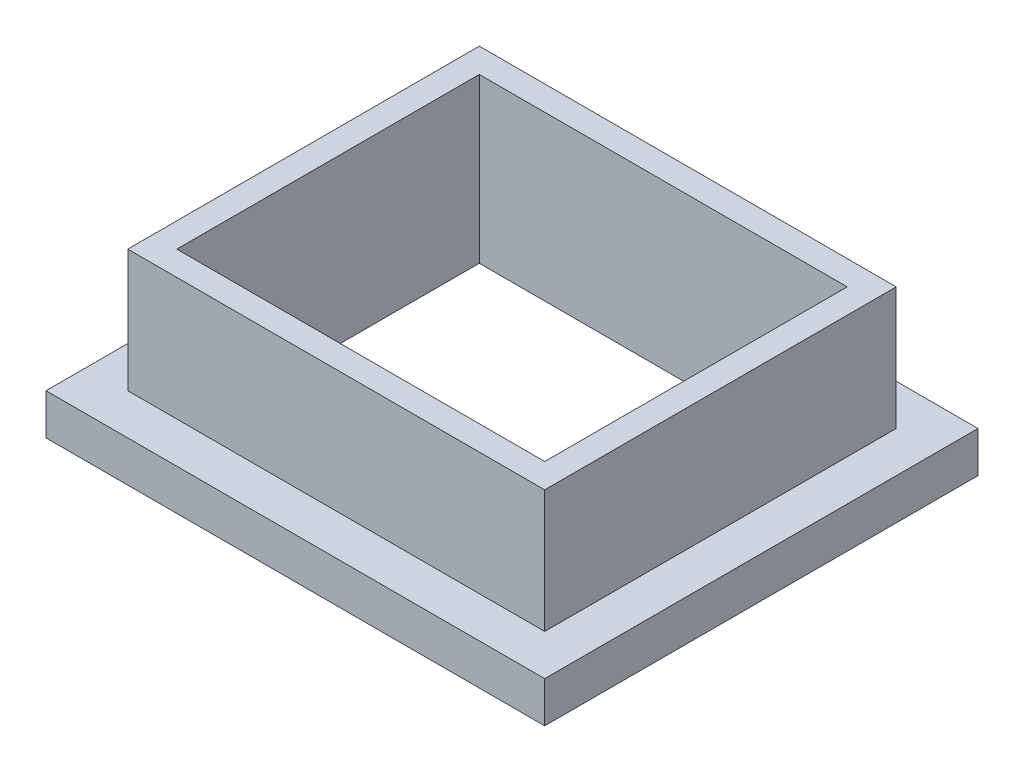
ISO-10303-21;
HEADER;
FILE_DESCRIPTION(('STEP AP214'),'2;1');
FILE_NAME('part.step','',(''),(''),'','','');
FILE_SCHEMA(('AUTOMOTIVE_DESIGN { 1 0 10303 214 1 1 1 1 }'));
ENDSEC;
DATA;
#1=APPLICATION_CONTEXT('core data for automotive mechanical design processes');
#2=APPLICATION_PROTOCOL_DEFINITION('international standard','automotive_design',2000,#1);
#3=PRODUCT_CONTEXT('',#1,'mechanical');
#4=PRODUCT('Part','Part','',(#3));
#5=PRODUCT_RELATED_PRODUCT_CATEGORY('part','',(#4));
#6=PRODUCT_DEFINITION_FORMATION('','',#4);
#7=PRODUCT_DEFINITION_CONTEXT('part definition',#1,'design');
#8=PRODUCT_DEFINITION('design','',#6,#7);
#9=PRODUCT_DEFINITION_SHAPE('','',#8);
#10=(LENGTH_UNIT() NAMED_UNIT(*) SI_UNIT(.MILLI.,.METRE.));
#11=(NAMED_UNIT(*) PLANE_ANGLE_UNIT() SI_UNIT($,.RADIAN.));
#12=(NAMED_UNIT(*) SI_UNIT($,.STERADIAN.) SOLID_ANGLE_UNIT());
#13=UNCERTAINTY_MEASURE_WITH_UNIT(LENGTH_MEASURE(1.E-05),#10,'distance_accuracy_value','');
#14=(GEOMETRIC_REPRESENTATION_CONTEXT(3) GLOBAL_UNCERTAINTY_ASSIGNED_CONTEXT((#13)) GLOBAL_UNIT_ASSIGNED_CONTEXT((#10,
#11,#12)) REPRESENTATION_CONTEXT('',''));
#15=CARTESIAN_POINT('',(0.,0.,0.));
#16=DIRECTION('',(0.,0.,1.));
#17=DIRECTION('',(1.,0.,0.));
#18=AXIS2_PLACEMENT_3D('',#15,#16,#17);
#19=CARTESIAN_POINT('',(0.,5.,0.));
#20=DIRECTION('',(0.,-1.,0.));
#21=DIRECTION('',(0.,0.,-1.));
#22=AXIS2_PLACEMENT_3D('',#19,#20,#21);
#23=PLANE('',#22);
#24=DIRECTION('',(0.,0.,1.));
#25=VECTOR('',#24,1.);
#26=CARTESIAN_POINT('',(0.,5.,0.));
#27=LINE('',#26,#25);
#28=CARTESIAN_POINT('',(0.,5.,-53.));
#29=VERTEX_POINT('',#28);
#30=CARTESIAN_POINT('',(0.,5.,0.));
#31=VERTEX_POINT('',#30);
#32=EDGE_CURVE('E235',#29,#31,#27,.T.);
#33=ORIENTED_EDGE('',*,*,#32,.T.);
#34=DIRECTION('',(1.,0.,0.));
#35=VECTOR('',#34,1.);
#36=CARTESIAN_POINT('',(0.,5.,0.));
#37=LINE('',#36,#35);
#38=CARTESIAN_POINT('',(61.,5.,0.));
#39=VERTEX_POINT('',#38);
#40=EDGE_CURVE('E92',#31,#39,#37,.T.);
#41=ORIENTED_EDGE('',*,*,#40,.T.);
#42=DIRECTION('',(0.,0.,-1.));
#43=VECTOR('',#42,1.);
#44=CARTESIAN_POINT('',(61.,5.,0.));
#45=LINE('',#44,#43);
#46=CARTESIAN_POINT('',(61.,5.,-53.));
#47=VERTEX_POINT('',#46);
#48=EDGE_CURVE('E240',#39,#47,#45,.T.);
#49=ORIENTED_EDGE('',*,*,#48,.T.);
#50=DIRECTION('',(-1.,0.,0.));
#51=VECTOR('',#50,1.);
#52=CARTESIAN_POINT('',(0.,5.,-53.));
#53=LINE('',#52,#51);
#54=EDGE_CURVE('E64',#47,#29,#53,.T.);
#55=ORIENTED_EDGE('',*,*,#54,.T.);
#56=EDGE_LOOP('',(#33,#41,#49,#55));
#57=FACE_BOUND('',#56,.T.);
#58=DIRECTION('',(0.,0.,1.));
#59=VECTOR('',#58,1.);
#60=CARTESIAN_POINT('',(5.,5.,-48.));
#61=LINE('',#60,#59);
#62=CARTESIAN_POINT('',(5.,5.,-48.));
#63=VERTEX_POINT('',#62);
#64=CARTESIAN_POINT('',(5.00000000000001,5.,-5.));
#65=VERTEX_POINT('',#64);
#66=EDGE_CURVE('E221',#63,#65,#61,.T.);
#67=ORIENTED_EDGE('',*,*,#66,.F.);
#68=DIRECTION('',(-1.,0.,0.));
#69=VECTOR('',#68,1.);
#70=CARTESIAN_POINT('',(5.,5.,-48.));
#71=LINE('',#70,#69);
#72=CARTESIAN_POINT('',(56.,5.,-48.));
#73=VERTEX_POINT('',#72);
#74=EDGE_CURVE('E55',#73,#63,#71,.T.);
#75=ORIENTED_EDGE('',*,*,#74,.F.);
#76=DIRECTION('',(0.,0.,-1.));
#77=VECTOR('',#76,1.);
#78=CARTESIAN_POINT('',(56.,5.,-48.));
#79=LINE('',#78,#77);
#80=CARTESIAN_POINT('',(56.,5.,-5.));
#81=VERTEX_POINT('',#80);
#82=EDGE_CURVE('E229',#81,#73,#79,.T.);
#83=ORIENTED_EDGE('',*,*,#82,.F.);
#84=DIRECTION('',(1.,0.,0.));
#85=VECTOR('',#84,1.);
#86=CARTESIAN_POINT('',(5.00000000000001,5.,-5.));
#87=LINE('',#86,#85);
#88=EDGE_CURVE('E225',#65,#81,#87,.T.);
#89=ORIENTED_EDGE('',*,*,#88,.F.);
#90=EDGE_LOOP('',(#67,#75,#83,#89));
#91=FACE_BOUND('',#90,.T.);
#92=ADVANCED_FACE('F39',(#57,#91),#23,.F.);
#93=CARTESIAN_POINT('',(0.,0.,0.));
#94=DIRECTION('',(0.,-1.,0.));
#95=DIRECTION('',(0.,0.,-1.));
#96=AXIS2_PLACEMENT_3D('',#93,#94,#95);
#97=PLANE('',#96);
#98=DIRECTION('',(0.,0.,1.));
#99=VECTOR('',#98,1.);
#100=CARTESIAN_POINT('',(0.,0.,0.));
#101=LINE('',#100,#99);
#102=CARTESIAN_POINT('',(0.,0.,-53.));
#103=VERTEX_POINT('',#102);
#104=CARTESIAN_POINT('',(0.,0.,0.));
#105=VERTEX_POINT('',#104);
#106=EDGE_CURVE('E234',#103,#105,#101,.T.);
#107=ORIENTED_EDGE('',*,*,#106,.F.);
#108=DIRECTION('',(-1.,0.,0.));
#109=VECTOR('',#108,1.);
#110=CARTESIAN_POINT('',(0.,0.,-53.));
#111=LINE('',#110,#109);
#112=CARTESIAN_POINT('',(61.,0.,-53.));
#113=VERTEX_POINT('',#112);
#114=EDGE_CURVE('E85',#113,#103,#111,.T.);
#115=ORIENTED_EDGE('',*,*,#114,.F.);
#116=DIRECTION('',(0.,0.,-1.));
#117=VECTOR('',#116,1.);
#118=CARTESIAN_POINT('',(61.,0.,0.));
#119=LINE('',#118,#117);
#120=CARTESIAN_POINT('',(61.,0.,0.));
#121=VERTEX_POINT('',#120);
#122=EDGE_CURVE('E252',#121,#113,#119,.T.);
#123=ORIENTED_EDGE('',*,*,#122,.F.);
#124=DIRECTION('',(1.,0.,0.));
#125=VECTOR('',#124,1.);
#126=CARTESIAN_POINT('',(0.,0.,0.));
#127=LINE('',#126,#125);
#128=EDGE_CURVE('E249',#105,#121,#127,.T.);
#129=ORIENTED_EDGE('',*,*,#128,.F.);
#130=EDGE_LOOP('',(#107,#115,#123,#129));
#131=FACE_BOUND('',#130,.T.);
#132=DIRECTION('',(0.,0.,1.));
#133=VECTOR('',#132,1.);
#134=CARTESIAN_POINT('',(8.,0.,-45.));
#135=LINE('',#134,#133);
#136=CARTESIAN_POINT('',(8.,0.,-45.));
#137=VERTEX_POINT('',#136);
#138=CARTESIAN_POINT('',(8.00000000000001,0.,-8.));
#139=VERTEX_POINT('',#138);
#140=EDGE_CURVE('E174',#137,#139,#135,.T.);
#141=ORIENTED_EDGE('',*,*,#140,.T.);
#142=DIRECTION('',(1.,0.,0.));
#143=VECTOR('',#142,1.);
#144=CARTESIAN_POINT('',(8.00000000000001,0.,-8.));
#145=LINE('',#144,#143);
#146=CARTESIAN_POINT('',(53.,0.,-8.));
#147=VERTEX_POINT('',#146);
#148=EDGE_CURVE('E157',#139,#147,#145,.T.);
#149=ORIENTED_EDGE('',*,*,#148,.T.);
#150=DIRECTION('',(0.,0.,-1.));
#151=VECTOR('',#150,1.);
#152=CARTESIAN_POINT('',(53.,0.,-45.));
#153=LINE('',#152,#151);
#154=CARTESIAN_POINT('',(53.,0.,-45.));
#155=VERTEX_POINT('',#154);
#156=EDGE_CURVE('E179',#147,#155,#153,.T.);
#157=ORIENTED_EDGE('',*,*,#156,.T.);
#158=DIRECTION('',(-1.,0.,0.));
#159=VECTOR('',#158,1.);
#160=CARTESIAN_POINT('',(8.,0.,-45.));
#161=LINE('',#160,#159);
#162=EDGE_CURVE('E151',#155,#137,#161,.T.);
#163=ORIENTED_EDGE('',*,*,#162,.T.);
#164=EDGE_LOOP('',(#141,#149,#157,#163));
#165=FACE_BOUND('',#164,.T.);
#166=ADVANCED_FACE('F270',(#131,#165),#97,.T.);
#167=CARTESIAN_POINT('',(0.,5.,0.));
#168=DIRECTION('',(1.,0.,0.));
#169=DIRECTION('',(0.,0.,-1.));
#170=AXIS2_PLACEMENT_3D('',#167,#168,#169);
#171=PLANE('',#170);
#172=ORIENTED_EDGE('',*,*,#106,.T.);
#173=DIRECTION('',(0.,-1.,0.));
#174=VECTOR('',#173,1.);
#175=CARTESIAN_POINT('',(0.,5.,0.));
#176=LINE('',#175,#174);
#177=EDGE_CURVE('E11',#31,#105,#176,.T.);
#178=ORIENTED_EDGE('',*,*,#177,.F.);
#179=ORIENTED_EDGE('',*,*,#32,.F.);
#180=DIRECTION('',(0.,-1.,0.));
#181=VECTOR('',#180,1.);
#182=CARTESIAN_POINT('',(0.,5.,-53.));
#183=LINE('',#182,#181);
#184=EDGE_CURVE('E245',#29,#103,#183,.T.);
#185=ORIENTED_EDGE('',*,*,#184,.T.);
#186=EDGE_LOOP('',(#172,#178,#179,#185));
#187=FACE_BOUND('',#186,.T.);
#188=ADVANCED_FACE('F41',(#187),#171,.F.);
#189=CARTESIAN_POINT('',(0.,5.,0.));
#190=DIRECTION('',(0.,0.,-1.));
#191=DIRECTION('',(-1.,0.,0.));
#192=AXIS2_PLACEMENT_3D('',#189,#190,#191);
#193=PLANE('',#192);
#194=ORIENTED_EDGE('',*,*,#128,.T.);
#195=DIRECTION('',(0.,-1.,0.));
#196=VECTOR('',#195,1.);
#197=CARTESIAN_POINT('',(61.,5.,0.));
#198=LINE('',#197,#196);
#199=EDGE_CURVE('E48',#39,#121,#198,.T.);
#200=ORIENTED_EDGE('',*,*,#199,.F.);
#201=ORIENTED_EDGE('',*,*,#40,.F.);
#202=ORIENTED_EDGE('',*,*,#177,.T.);
#203=EDGE_LOOP('',(#194,#200,#201,#202));
#204=FACE_BOUND('',#203,.T.);
#205=ADVANCED_FACE('F286',(#204),#193,.F.);
#206=CARTESIAN_POINT('',(61.,5.,0.));
#207=DIRECTION('',(-1.,0.,0.));
#208=DIRECTION('',(0.,0.,1.));
#209=AXIS2_PLACEMENT_3D('',#206,#207,#208);
#210=PLANE('',#209);
#211=ORIENTED_EDGE('',*,*,#122,.T.);
#212=DIRECTION('',(0.,-1.,0.));
#213=VECTOR('',#212,1.);
#214=CARTESIAN_POINT('',(61.,5.,-53.));
#215=LINE('',#214,#213);
#216=EDGE_CURVE('E259',#47,#113,#215,.T.);
#217=ORIENTED_EDGE('',*,*,#216,.F.);
#218=ORIENTED_EDGE('',*,*,#48,.F.);
#219=ORIENTED_EDGE('',*,*,#199,.T.);
#220=EDGE_LOOP('',(#211,#217,#218,#219));
#221=FACE_BOUND('',#220,.T.);
#222=ADVANCED_FACE('F266',(#221),#210,.F.);
#223=CARTESIAN_POINT('',(0.,5.,-53.));
#224=DIRECTION('',(0.,0.,1.));
#225=DIRECTION('',(1.,0.,0.));
#226=AXIS2_PLACEMENT_3D('',#223,#224,#225);
#227=PLANE('',#226);
#228=ORIENTED_EDGE('',*,*,#114,.T.);
#229=ORIENTED_EDGE('',*,*,#184,.F.);
#230=ORIENTED_EDGE('',*,*,#54,.F.);
#231=ORIENTED_EDGE('',*,*,#216,.T.);
#232=EDGE_LOOP('',(#228,#229,#230,#231));
#233=FACE_BOUND('',#232,.T.);
#234=ADVANCED_FACE('F275',(#233),#227,.F.);
#235=CARTESIAN_POINT('',(5.,20.,-5.));
#236=DIRECTION('',(0.,0.,-1.));
#237=DIRECTION('',(-1.,0.,0.));
#238=AXIS2_PLACEMENT_3D('',#235,#236,#237);
#239=PLANE('',#238);
#240=DIRECTION('',(0.,-1.,0.));
#241=VECTOR('',#240,1.);
#242=CARTESIAN_POINT('',(5.,20.,-5.));
#243=LINE('',#242,#241);
#244=CARTESIAN_POINT('',(5.,20.,-5.));
#245=VERTEX_POINT('',#244);
#246=EDGE_CURVE('E217',#245,#65,#243,.T.);
#247=ORIENTED_EDGE('',*,*,#246,.T.);
#248=ORIENTED_EDGE('',*,*,#88,.T.);
#249=DIRECTION('',(0.,-1.,0.));
#250=VECTOR('',#249,1.);
#251=CARTESIAN_POINT('',(56.,20.,-5.));
#252=LINE('',#251,#250);
#253=CARTESIAN_POINT('',(56.,20.,-5.));
#254=VERTEX_POINT('',#253);
#255=EDGE_CURVE('E213',#254,#81,#252,.T.);
#256=ORIENTED_EDGE('',*,*,#255,.F.);
#257=DIRECTION('',(1.,0.,0.));
#258=VECTOR('',#257,1.);
#259=CARTESIAN_POINT('',(5.,20.,-5.));
#260=LINE('',#259,#258);
#261=EDGE_CURVE('E196',#245,#254,#260,.T.);
#262=ORIENTED_EDGE('',*,*,#261,.F.);
#263=EDGE_LOOP('',(#247,#248,#256,#262));
#264=FACE_BOUND('',#263,.T.);
#265=ADVANCED_FACE('F277',(#264),#239,.F.);
#266=CARTESIAN_POINT('',(5.,20.,-48.));
#267=DIRECTION('',(0.,0.,1.));
#268=DIRECTION('',(1.,0.,0.));
#269=AXIS2_PLACEMENT_3D('',#266,#267,#268);
#270=PLANE('',#269);
#271=DIRECTION('',(0.,-1.,0.));
#272=VECTOR('',#271,1.);
#273=CARTESIAN_POINT('',(56.,20.,-48.));
#274=LINE('',#273,#272);
#275=CARTESIAN_POINT('',(56.,20.,-48.));
#276=VERTEX_POINT('',#275);
#277=EDGE_CURVE('E209',#276,#73,#274,.T.);
#278=ORIENTED_EDGE('',*,*,#277,.T.);
#279=ORIENTED_EDGE('',*,*,#74,.T.);
#280=DIRECTION('',(0.,-1.,0.));
#281=VECTOR('',#280,1.);
#282=CARTESIAN_POINT('',(5.,20.,-48.));
#283=LINE('',#282,#281);
#284=CARTESIAN_POINT('',(5.,20.,-48.));
#285=VERTEX_POINT('',#284);
#286=EDGE_CURVE('E205',#285,#63,#283,.T.);
#287=ORIENTED_EDGE('',*,*,#286,.F.);
#288=DIRECTION('',(-1.,0.,0.));
#289=VECTOR('',#288,1.);
#290=CARTESIAN_POINT('',(5.,20.,-48.));
#291=LINE('',#290,#289);
#292=EDGE_CURVE('E202',#276,#285,#291,.T.);
#293=ORIENTED_EDGE('',*,*,#292,.F.);
#294=EDGE_LOOP('',(#278,#279,#287,#293));
#295=FACE_BOUND('',#294,.T.);
#296=ADVANCED_FACE('F283',(#295),#270,.F.);
#297=CARTESIAN_POINT('',(5.,20.,-48.));
#298=DIRECTION('',(1.,0.,0.));
#299=DIRECTION('',(0.,0.,-1.));
#300=AXIS2_PLACEMENT_3D('',#297,#298,#299);
#301=PLANE('',#300);
#302=ORIENTED_EDGE('',*,*,#286,.T.);
#303=ORIENTED_EDGE('',*,*,#66,.T.);
#304=ORIENTED_EDGE('',*,*,#246,.F.);
#305=DIRECTION('',(0.,0.,1.));
#306=VECTOR('',#305,1.);
#307=CARTESIAN_POINT('',(5.,20.,-48.));
#308=LINE('',#307,#306);
#309=EDGE_CURVE('E159',#285,#245,#308,.T.);
#310=ORIENTED_EDGE('',*,*,#309,.F.);
#311=EDGE_LOOP('',(#302,#303,#304,#310));
#312=FACE_BOUND('',#311,.T.);
#313=ADVANCED_FACE('F295',(#312),#301,.F.);
#314=CARTESIAN_POINT('',(56.,20.,-48.));
#315=DIRECTION('',(-1.,0.,0.));
#316=DIRECTION('',(0.,0.,1.));
#317=AXIS2_PLACEMENT_3D('',#314,#315,#316);
#318=PLANE('',#317);
#319=ORIENTED_EDGE('',*,*,#255,.T.);
#320=ORIENTED_EDGE('',*,*,#82,.T.);
#321=ORIENTED_EDGE('',*,*,#277,.F.);
#322=DIRECTION('',(0.,0.,-1.));
#323=VECTOR('',#322,1.);
#324=CARTESIAN_POINT('',(56.,20.,-48.));
#325=LINE('',#324,#323);
#326=EDGE_CURVE('E199',#254,#276,#325,.T.);
#327=ORIENTED_EDGE('',*,*,#326,.F.);
#328=EDGE_LOOP('',(#319,#320,#321,#327));
#329=FACE_BOUND('',#328,.T.);
#330=ADVANCED_FACE('F297',(#329),#318,.F.);
#331=CARTESIAN_POINT('',(0.,20.,0.));
#332=DIRECTION('',(0.,1.,0.));
#333=DIRECTION('',(0.,0.,1.));
#334=AXIS2_PLACEMENT_3D('',#331,#332,#333);
#335=PLANE('',#334);
#336=ORIENTED_EDGE('',*,*,#309,.T.);
#337=ORIENTED_EDGE('',*,*,#261,.T.);
#338=ORIENTED_EDGE('',*,*,#326,.T.);
#339=ORIENTED_EDGE('',*,*,#292,.T.);
#340=EDGE_LOOP('',(#336,#337,#338,#339));
#341=FACE_BOUND('',#340,.T.);
#342=DIRECTION('',(1.,0.,0.));
#343=VECTOR('',#342,1.);
#344=CARTESIAN_POINT('',(8.00000000000001,20.,-8.));
#345=LINE('',#344,#343);
#346=CARTESIAN_POINT('',(8.00000000000001,20.,-8.));
#347=VERTEX_POINT('',#346);
#348=CARTESIAN_POINT('',(53.,20.,-8.));
#349=VERTEX_POINT('',#348);
#350=EDGE_CURVE('E150',#347,#349,#345,.T.);
#351=ORIENTED_EDGE('',*,*,#350,.F.);
#352=DIRECTION('',(0.,0.,1.));
#353=VECTOR('',#352,1.);
#354=CARTESIAN_POINT('',(8.,20.,-45.));
#355=LINE('',#354,#353);
#356=CARTESIAN_POINT('',(8.,20.,-45.));
#357=VERTEX_POINT('',#356);
#358=EDGE_CURVE('E139',#357,#347,#355,.T.);
#359=ORIENTED_EDGE('',*,*,#358,.F.);
#360=DIRECTION('',(-1.,0.,0.));
#361=VECTOR('',#360,1.);
#362=CARTESIAN_POINT('',(8.,20.,-45.));
#363=LINE('',#362,#361);
#364=CARTESIAN_POINT('',(53.,20.,-45.));
#365=VERTEX_POINT('',#364);
#366=EDGE_CURVE('E169',#365,#357,#363,.T.);
#367=ORIENTED_EDGE('',*,*,#366,.F.);
#368=DIRECTION('',(0.,0.,-1.));
#369=VECTOR('',#368,1.);
#370=CARTESIAN_POINT('',(53.,20.,-45.));
#371=LINE('',#370,#369);
#372=EDGE_CURVE('E165',#349,#365,#371,.T.);
#373=ORIENTED_EDGE('',*,*,#372,.F.);
#374=EDGE_LOOP('',(#351,#359,#367,#373));
#375=FACE_BOUND('',#374,.T.);
#376=ADVANCED_FACE('F163',(#341,#375),#335,.T.);
#377=CARTESIAN_POINT('',(8.,20.,-45.));
#378=DIRECTION('',(1.,0.,0.));
#379=DIRECTION('',(0.,0.,-1.));
#380=AXIS2_PLACEMENT_3D('',#377,#378,#379);
#381=PLANE('',#380);
#382=ORIENTED_EDGE('',*,*,#140,.F.);
#383=DIRECTION('',(0.,-1.,0.));
#384=VECTOR('',#383,1.);
#385=CARTESIAN_POINT('',(8.,20.,-45.));
#386=LINE('',#385,#384);
#387=EDGE_CURVE('E145',#357,#137,#386,.T.);
#388=ORIENTED_EDGE('',*,*,#387,.F.);
#389=ORIENTED_EDGE('',*,*,#358,.T.);
#390=DIRECTION('',(0.,-1.,0.));
#391=VECTOR('',#390,1.);
#392=CARTESIAN_POINT('',(8.00000000000001,20.,-8.));
#393=LINE('',#392,#391);
#394=EDGE_CURVE('E142',#347,#139,#393,.T.);
#395=ORIENTED_EDGE('',*,*,#394,.T.);
#396=EDGE_LOOP('',(#382,#388,#389,#395));
#397=FACE_BOUND('',#396,.T.);
#398=ADVANCED_FACE('F141',(#397),#381,.T.);
#399=CARTESIAN_POINT('',(8.00000000000001,20.,-8.));
#400=DIRECTION('',(0.,0.,-1.));
#401=DIRECTION('',(-1.,0.,0.));
#402=AXIS2_PLACEMENT_3D('',#399,#400,#401);
#403=PLANE('',#402);
#404=ORIENTED_EDGE('',*,*,#148,.F.);
#405=ORIENTED_EDGE('',*,*,#394,.F.);
#406=ORIENTED_EDGE('',*,*,#350,.T.);
#407=DIRECTION('',(0.,-1.,0.));
#408=VECTOR('',#407,1.);
#409=CARTESIAN_POINT('',(53.,20.,-8.));
#410=LINE('',#409,#408);
#411=EDGE_CURVE('E160',#349,#147,#410,.T.);
#412=ORIENTED_EDGE('',*,*,#411,.T.);
#413=EDGE_LOOP('',(#404,#405,#406,#412));
#414=FACE_BOUND('',#413,.T.);
#415=ADVANCED_FACE('F154',(#414),#403,.T.);
#416=CARTESIAN_POINT('',(53.,20.,-45.));
#417=DIRECTION('',(-1.,0.,0.));
#418=DIRECTION('',(0.,0.,1.));
#419=AXIS2_PLACEMENT_3D('',#416,#417,#418);
#420=PLANE('',#419);
#421=ORIENTED_EDGE('',*,*,#156,.F.);
#422=ORIENTED_EDGE('',*,*,#411,.F.);
#423=ORIENTED_EDGE('',*,*,#372,.T.);
#424=DIRECTION('',(0.,-1.,0.));
#425=VECTOR('',#424,1.);
#426=CARTESIAN_POINT('',(53.,20.,-45.));
#427=LINE('',#426,#425);
#428=EDGE_CURVE('E188',#365,#155,#427,.T.);
#429=ORIENTED_EDGE('',*,*,#428,.T.);
#430=EDGE_LOOP('',(#421,#422,#423,#429));
#431=FACE_BOUND('',#430,.T.);
#432=ADVANCED_FACE('F313',(#431),#420,.T.);
#433=CARTESIAN_POINT('',(8.,20.,-45.));
#434=DIRECTION('',(0.,0.,1.));
#435=DIRECTION('',(1.,0.,0.));
#436=AXIS2_PLACEMENT_3D('',#433,#434,#435);
#437=PLANE('',#436);
#438=ORIENTED_EDGE('',*,*,#162,.F.);
#439=ORIENTED_EDGE('',*,*,#428,.F.);
#440=ORIENTED_EDGE('',*,*,#366,.T.);
#441=ORIENTED_EDGE('',*,*,#387,.T.);
#442=EDGE_LOOP('',(#438,#439,#440,#441));
#443=FACE_BOUND('',#442,.T.);
#444=ADVANCED_FACE('F316',(#443),#437,.T.);
#445=CLOSED_SHELL('',(#92,#166,#188,#205,#222,#234,#265,#296,#313,#330,#376,#398,#415,#432,#444));
#446=MANIFOLD_SOLID_BREP('B2',#445);
#447=ADVANCED_BREP_SHAPE_REPRESENTATION('',(#18,#446),#14);
#448=SHAPE_DEFINITION_REPRESENTATION(#9,#447);
ENDSEC;
END-ISO-10303-21;
